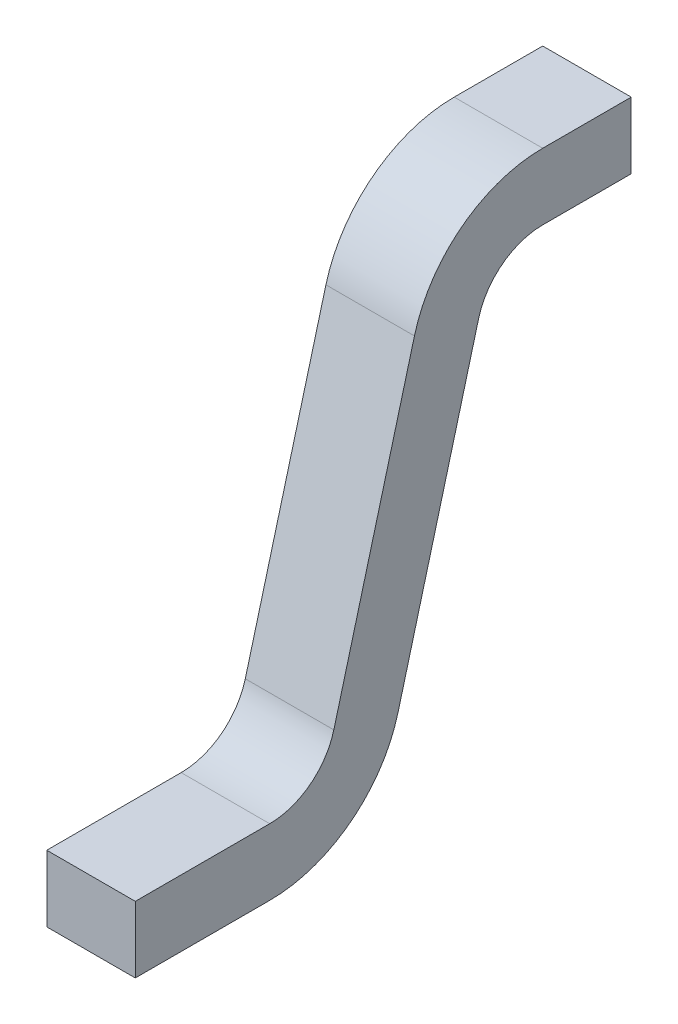
ISO-10303-21;
HEADER;
FILE_DESCRIPTION(('STEP AP214'),'2;1');
FILE_NAME('part.step','',(''),(''),'','','');
FILE_SCHEMA(('AUTOMOTIVE_DESIGN { 1 0 10303 214 1 1 1 1 }'));
ENDSEC;
DATA;
#1=APPLICATION_CONTEXT('core data for automotive mechanical design processes');
#2=APPLICATION_PROTOCOL_DEFINITION('international standard','automotive_design',2000,#1);
#3=PRODUCT_CONTEXT('',#1,'mechanical');
#4=PRODUCT('Part','Part','',(#3));
#5=PRODUCT_RELATED_PRODUCT_CATEGORY('part','',(#4));
#6=PRODUCT_DEFINITION_FORMATION('','',#4);
#7=PRODUCT_DEFINITION_CONTEXT('part definition',#1,'design');
#8=PRODUCT_DEFINITION('design','',#6,#7);
#9=PRODUCT_DEFINITION_SHAPE('','',#8);
#10=(LENGTH_UNIT() NAMED_UNIT(*) SI_UNIT(.MILLI.,.METRE.));
#11=(NAMED_UNIT(*) PLANE_ANGLE_UNIT() SI_UNIT($,.RADIAN.));
#12=(NAMED_UNIT(*) SI_UNIT($,.STERADIAN.) SOLID_ANGLE_UNIT());
#13=UNCERTAINTY_MEASURE_WITH_UNIT(LENGTH_MEASURE(1.E-05),#10,'distance_accuracy_value','');
#14=(GEOMETRIC_REPRESENTATION_CONTEXT(3) GLOBAL_UNCERTAINTY_ASSIGNED_CONTEXT((#13)) GLOBAL_UNIT_ASSIGNED_CONTEXT((#10,
#11,#12)) REPRESENTATION_CONTEXT('',''));
#15=CARTESIAN_POINT('',(0.,0.,0.));
#16=DIRECTION('',(0.,0.,1.));
#17=DIRECTION('',(1.,0.,0.));
#18=AXIS2_PLACEMENT_3D('',#15,#16,#17);
#19=CARTESIAN_POINT('',(-0.1,-1.01320558087763,-0.479564779095964));
#20=DIRECTION('',(-1.,0.,0.));
#21=DIRECTION('',(0.,1.,0.));
#22=AXIS2_PLACEMENT_3D('',#19,#20,#21);
#23=PLANE('',#22);
#24=DIRECTION('',(0.,0.,-1.));
#25=VECTOR('',#24,1.);
#26=CARTESIAN_POINT('',(-0.1,0.,0.8));
#27=LINE('',#26,#25);
#28=CARTESIAN_POINT('',(-0.1,0.,0.2));
#29=VERTEX_POINT('',#28);
#30=CARTESIAN_POINT('',(-0.1,0.,0.));
#31=VERTEX_POINT('',#30);
#32=EDGE_CURVE('E212',#29,#31,#27,.T.);
#33=ORIENTED_EDGE('',*,*,#32,.F.);
#34=CARTESIAN_POINT('',(-0.1,-0.15,0.2));
#35=DIRECTION('',(1.,0.,0.));
#36=DIRECTION('',(0.,0.,-1.));
#37=AXIS2_PLACEMENT_3D('',#34,#35,#36);
#38=CIRCLE('',#37,0.15);
#39=CARTESIAN_POINT('',(-0.1,-0.111177143234622,0.34488887394336));
#40=VERTEX_POINT('',#39);
#41=EDGE_CURVE('E150',#29,#40,#38,.T.);
#42=ORIENTED_EDGE('',*,*,#41,.T.);
#43=DIRECTION('',(0.,0.965925826289068,-0.258819045102521));
#44=VECTOR('',#43,1.);
#45=CARTESIAN_POINT('',(-0.1,-0.501073546521664,0.449361300335922));
#46=LINE('',#45,#44);
#47=CARTESIAN_POINT('',(-0.1,-0.790851294408385,0.527007013866678));
#48=VERTEX_POINT('',#47);
#49=EDGE_CURVE('E145',#48,#40,#46,.T.);
#50=ORIENTED_EDGE('',*,*,#49,.F.);
#51=CARTESIAN_POINT('',(-0.1,-0.713205580877628,0.816784761753399));
#52=DIRECTION('',(1.,0.,0.));
#53=DIRECTION('',(0.,-1.,0.));
#54=AXIS2_PLACEMENT_3D('',#51,#52,#53);
#55=CIRCLE('',#54,0.3);
#56=CARTESIAN_POINT('',(-0.1,-1.01320558087763,0.816784761753399));
#57=VERTEX_POINT('',#56);
#58=EDGE_CURVE('E225',#57,#48,#55,.T.);
#59=ORIENTED_EDGE('',*,*,#58,.F.);
#60=DIRECTION('',(0.,0.,-1.));
#61=VECTOR('',#60,1.);
#62=CARTESIAN_POINT('',(-0.1,-1.01320558087763,0.320435220904037));
#63=LINE('',#62,#61);
#64=CARTESIAN_POINT('',(-0.1,-1.01320558087763,1.12043522090404));
#65=VERTEX_POINT('',#64);
#66=EDGE_CURVE('E192',#65,#57,#63,.T.);
#67=ORIENTED_EDGE('',*,*,#66,.F.);
#68=DIRECTION('',(0.,-1.,0.));
#69=VECTOR('',#68,1.);
#70=CARTESIAN_POINT('',(-0.1,-1.01320558087763,1.12043522090404));
#71=LINE('',#70,#69);
#72=CARTESIAN_POINT('',(-0.1,-0.863205580877628,1.12043522090404));
#73=VERTEX_POINT('',#72);
#74=EDGE_CURVE('E185',#73,#65,#71,.T.);
#75=ORIENTED_EDGE('',*,*,#74,.F.);
#76=DIRECTION('',(0.,0.,1.));
#77=VECTOR('',#76,1.);
#78=CARTESIAN_POINT('',(-0.1,-0.863205580877628,0.320435220904037));
#79=LINE('',#78,#77);
#80=CARTESIAN_POINT('',(-0.1,-0.863205580877628,0.816784761753399));
#81=VERTEX_POINT('',#80);
#82=EDGE_CURVE('E237',#81,#73,#79,.T.);
#83=ORIENTED_EDGE('',*,*,#82,.F.);
#84=CARTESIAN_POINT('',(-0.1,-0.713205580877628,0.816784761753399));
#85=DIRECTION('',(1.,0.,0.));
#86=DIRECTION('',(0.,-1.,0.));
#87=AXIS2_PLACEMENT_3D('',#84,#85,#86);
#88=CIRCLE('',#87,0.15);
#89=CARTESIAN_POINT('',(-0.1,-0.752028437643006,0.671895887810039));
#90=VERTEX_POINT('',#89);
#91=EDGE_CURVE('E20',#81,#90,#88,.T.);
#92=ORIENTED_EDGE('',*,*,#91,.T.);
#93=DIRECTION('',(0.,-0.965925826289068,0.258819045102521));
#94=VECTOR('',#93,1.);
#95=CARTESIAN_POINT('',(-0.1,-0.462250689756285,0.594250174279283));
#96=LINE('',#95,#94);
#97=CARTESIAN_POINT('',(-0.1,-0.0723542864692436,0.489777747886721));
#98=VERTEX_POINT('',#97);
#99=EDGE_CURVE('E11',#98,#90,#96,.T.);
#100=ORIENTED_EDGE('',*,*,#99,.F.);
#101=CARTESIAN_POINT('',(-0.1,-0.15,0.2));
#102=DIRECTION('',(1.,0.,0.));
#103=DIRECTION('',(0.,0.,-1.));
#104=AXIS2_PLACEMENT_3D('',#101,#102,#103);
#105=CIRCLE('',#104,0.3);
#106=CARTESIAN_POINT('',(-0.1,0.15,0.2));
#107=VERTEX_POINT('',#106);
#108=EDGE_CURVE('E200',#107,#98,#105,.T.);
#109=ORIENTED_EDGE('',*,*,#108,.F.);
#110=DIRECTION('',(0.,0.,1.));
#111=VECTOR('',#110,1.);
#112=CARTESIAN_POINT('',(-0.1,0.15,0.8));
#113=LINE('',#112,#111);
#114=CARTESIAN_POINT('',(-0.1,0.15,0.));
#115=VERTEX_POINT('',#114);
#116=EDGE_CURVE('E183',#115,#107,#113,.T.);
#117=ORIENTED_EDGE('',*,*,#116,.F.);
#118=DIRECTION('',(0.,1.,0.));
#119=VECTOR('',#118,1.);
#120=CARTESIAN_POINT('',(-0.1,0.,0.));
#121=LINE('',#120,#119);
#122=EDGE_CURVE('E207',#31,#115,#121,.T.);
#123=ORIENTED_EDGE('',*,*,#122,.F.);
#124=EDGE_LOOP('',(#33,#42,#50,#59,#67,#75,#83,#92,#100,#109,#117,#123));
#125=FACE_BOUND('',#124,.T.);
#126=ADVANCED_FACE('F17',(#125),#23,.T.);
#127=CARTESIAN_POINT('',(0.,-0.462250689756285,0.594250174279283));
#128=DIRECTION('',(0.,0.258819045102521,0.965925826289068));
#129=DIRECTION('',(1.,0.,0.));
#130=AXIS2_PLACEMENT_3D('',#127,#128,#129);
#131=PLANE('',#130);
#132=DIRECTION('',(1.,0.,0.));
#133=VECTOR('',#132,1.);
#134=CARTESIAN_POINT('',(-0.297707469156736,-0.752028437643007,0.671895887810039));
#135=LINE('',#134,#133);
#136=CARTESIAN_POINT('',(0.1,-0.752028437643007,0.671895887810039));
#137=VERTEX_POINT('',#136);
#138=EDGE_CURVE('E239',#90,#137,#135,.T.);
#139=ORIENTED_EDGE('',*,*,#138,.T.);
#140=DIRECTION('',(0.,-0.965925826289068,0.258819045102521));
#141=VECTOR('',#140,1.);
#142=CARTESIAN_POINT('',(0.1,-0.0723542864692437,0.48977774788672));
#143=LINE('',#142,#141);
#144=CARTESIAN_POINT('',(0.1,-0.0723542864692436,0.48977774788672));
#145=VERTEX_POINT('',#144);
#146=EDGE_CURVE('E260',#145,#137,#143,.T.);
#147=ORIENTED_EDGE('',*,*,#146,.F.);
#148=DIRECTION('',(1.,0.,0.));
#149=VECTOR('',#148,1.);
#150=CARTESIAN_POINT('',(0.194661618624334,-0.0723542864692436,0.48977774788672));
#151=LINE('',#150,#149);
#152=EDGE_CURVE('E184',#98,#145,#151,.T.);
#153=ORIENTED_EDGE('',*,*,#152,.F.);
#154=ORIENTED_EDGE('',*,*,#99,.T.);
#155=EDGE_LOOP('',(#139,#147,#153,#154));
#156=FACE_BOUND('',#155,.T.);
#157=ADVANCED_FACE('F322',(#156),#131,.T.);
#158=CARTESIAN_POINT('',(-0.297707469156736,-0.713205580877628,0.816784761753399));
#159=DIRECTION('',(-1.,0.,0.));
#160=DIRECTION('',(0.,-1.,0.));
#161=AXIS2_PLACEMENT_3D('',#158,#159,#160);
#162=CYLINDRICAL_SURFACE('',#161,0.15);
#163=CARTESIAN_POINT('',(0.1,-0.713205580877628,0.816784761753399));
#164=DIRECTION('',(-1.,0.,0.));
#165=DIRECTION('',(0.,-1.,0.));
#166=AXIS2_PLACEMENT_3D('',#163,#164,#165);
#167=CIRCLE('',#166,0.15);
#168=CARTESIAN_POINT('',(0.1,-0.863205580877628,0.816784761753399));
#169=VERTEX_POINT('',#168);
#170=EDGE_CURVE('E254',#137,#169,#167,.T.);
#171=ORIENTED_EDGE('',*,*,#170,.F.);
#172=ORIENTED_EDGE('',*,*,#138,.F.);
#173=ORIENTED_EDGE('',*,*,#91,.F.);
#174=DIRECTION('',(-1.,0.,0.));
#175=VECTOR('',#174,1.);
#176=CARTESIAN_POINT('',(0.,-0.863205580877628,0.816784761753399));
#177=LINE('',#176,#175);
#178=EDGE_CURVE('E188',#169,#81,#177,.T.);
#179=ORIENTED_EDGE('',*,*,#178,.F.);
#180=EDGE_LOOP('',(#171,#172,#173,#179));
#181=FACE_BOUND('',#180,.T.);
#182=ADVANCED_FACE('F252',(#181),#162,.F.);
#183=CARTESIAN_POINT('',(0.,-0.863205580877628,0.320435220904037));
#184=DIRECTION('',(0.,1.,0.));
#185=DIRECTION('',(0.,0.,-1.));
#186=AXIS2_PLACEMENT_3D('',#183,#184,#185);
#187=PLANE('',#186);
#188=DIRECTION('',(-1.,0.,0.));
#189=VECTOR('',#188,1.);
#190=CARTESIAN_POINT('',(-0.1,-0.863205580877628,1.12043522090404));
#191=LINE('',#190,#189);
#192=CARTESIAN_POINT('',(0.1,-0.863205580877628,1.12043522090404));
#193=VERTEX_POINT('',#192);
#194=EDGE_CURVE('E189',#193,#73,#191,.T.);
#195=ORIENTED_EDGE('',*,*,#194,.F.);
#196=DIRECTION('',(0.,0.,1.));
#197=VECTOR('',#196,1.);
#198=CARTESIAN_POINT('',(0.1,-0.863205580877628,1.12043522090404));
#199=LINE('',#198,#197);
#200=EDGE_CURVE('E259',#169,#193,#199,.T.);
#201=ORIENTED_EDGE('',*,*,#200,.F.);
#202=ORIENTED_EDGE('',*,*,#178,.T.);
#203=ORIENTED_EDGE('',*,*,#82,.T.);
#204=EDGE_LOOP('',(#195,#201,#202,#203));
#205=FACE_BOUND('',#204,.T.);
#206=ADVANCED_FACE('F330',(#205),#187,.T.);
#207=CARTESIAN_POINT('',(-0.1,-1.01320558087763,1.12043522090404));
#208=DIRECTION('',(0.,0.,1.));
#209=DIRECTION('',(0.,-1.,0.));
#210=AXIS2_PLACEMENT_3D('',#207,#208,#209);
#211=PLANE('',#210);
#212=ORIENTED_EDGE('',*,*,#194,.T.);
#213=ORIENTED_EDGE('',*,*,#74,.T.);
#214=DIRECTION('',(-1.,0.,0.));
#215=VECTOR('',#214,1.);
#216=CARTESIAN_POINT('',(0.,-1.01320558087763,1.12043522090404));
#217=LINE('',#216,#215);
#218=CARTESIAN_POINT('',(0.1,-1.01320558087763,1.12043522090404));
#219=VERTEX_POINT('',#218);
#220=EDGE_CURVE('E228',#219,#65,#217,.T.);
#221=ORIENTED_EDGE('',*,*,#220,.F.);
#222=DIRECTION('',(0.,-1.,0.));
#223=VECTOR('',#222,1.);
#224=CARTESIAN_POINT('',(0.1,-1.01320558087763,1.12043522090404));
#225=LINE('',#224,#223);
#226=EDGE_CURVE('E276',#193,#219,#225,.T.);
#227=ORIENTED_EDGE('',*,*,#226,.F.);
#228=EDGE_LOOP('',(#212,#213,#221,#227));
#229=FACE_BOUND('',#228,.T.);
#230=ADVANCED_FACE('F338',(#229),#211,.T.);
#231=CARTESIAN_POINT('',(0.,-1.01320558087763,0.320435220904037));
#232=DIRECTION('',(0.,-1.,0.));
#233=DIRECTION('',(0.,0.,-1.));
#234=AXIS2_PLACEMENT_3D('',#231,#232,#233);
#235=PLANE('',#234);
#236=ORIENTED_EDGE('',*,*,#220,.T.);
#237=ORIENTED_EDGE('',*,*,#66,.T.);
#238=DIRECTION('',(-1.,0.,0.));
#239=VECTOR('',#238,1.);
#240=CARTESIAN_POINT('',(-0.297707469156736,-1.01320558087763,0.816784761753399));
#241=LINE('',#240,#239);
#242=CARTESIAN_POINT('',(0.1,-1.01320558087763,0.816784761753399));
#243=VERTEX_POINT('',#242);
#244=EDGE_CURVE('E221',#243,#57,#241,.T.);
#245=ORIENTED_EDGE('',*,*,#244,.F.);
#246=DIRECTION('',(0.,0.,-1.));
#247=VECTOR('',#246,1.);
#248=CARTESIAN_POINT('',(0.1,-1.01320558087763,1.12043522090404));
#249=LINE('',#248,#247);
#250=EDGE_CURVE('E174',#219,#243,#249,.T.);
#251=ORIENTED_EDGE('',*,*,#250,.F.);
#252=EDGE_LOOP('',(#236,#237,#245,#251));
#253=FACE_BOUND('',#252,.T.);
#254=ADVANCED_FACE('F334',(#253),#235,.T.);
#255=CARTESIAN_POINT('',(-0.297707469156736,-0.713205580877628,0.816784761753399));
#256=DIRECTION('',(-1.,0.,0.));
#257=DIRECTION('',(0.,-1.,0.));
#258=AXIS2_PLACEMENT_3D('',#255,#256,#257);
#259=CYLINDRICAL_SURFACE('',#258,0.3);
#260=DIRECTION('',(-1.,0.,0.));
#261=VECTOR('',#260,1.);
#262=CARTESIAN_POINT('',(0.,-0.790851294408385,0.527007013866679));
#263=LINE('',#262,#261);
#264=CARTESIAN_POINT('',(0.1,-0.790851294408385,0.527007013866679));
#265=VERTEX_POINT('',#264);
#266=EDGE_CURVE('E149',#265,#48,#263,.T.);
#267=ORIENTED_EDGE('',*,*,#266,.F.);
#268=CARTESIAN_POINT('',(0.1,-0.713205580877628,0.816784761753399));
#269=DIRECTION('',(1.,0.,0.));
#270=DIRECTION('',(0.,-1.,0.));
#271=AXIS2_PLACEMENT_3D('',#268,#269,#270);
#272=CIRCLE('',#271,0.3);
#273=EDGE_CURVE('E167',#243,#265,#272,.T.);
#274=ORIENTED_EDGE('',*,*,#273,.F.);
#275=ORIENTED_EDGE('',*,*,#244,.T.);
#276=ORIENTED_EDGE('',*,*,#58,.T.);
#277=EDGE_LOOP('',(#267,#274,#275,#276));
#278=FACE_BOUND('',#277,.T.);
#279=ADVANCED_FACE('F337',(#278),#259,.T.);
#280=CARTESIAN_POINT('',(0.,-0.501073546521664,0.449361300335922));
#281=DIRECTION('',(0.,-0.258819045102521,-0.965925826289068));
#282=DIRECTION('',(0.,-0.965925826289068,0.258819045102521));
#283=AXIS2_PLACEMENT_3D('',#280,#281,#282);
#284=PLANE('',#283);
#285=ORIENTED_EDGE('',*,*,#266,.T.);
#286=ORIENTED_EDGE('',*,*,#49,.T.);
#287=DIRECTION('',(1.,0.,0.));
#288=VECTOR('',#287,1.);
#289=CARTESIAN_POINT('',(0.194661618624334,-0.111177143234622,0.34488887394336));
#290=LINE('',#289,#288);
#291=CARTESIAN_POINT('',(0.1,-0.111177143234622,0.34488887394336));
#292=VERTEX_POINT('',#291);
#293=EDGE_CURVE('E137',#40,#292,#290,.T.);
#294=ORIENTED_EDGE('',*,*,#293,.T.);
#295=DIRECTION('',(0.,0.965925826289068,-0.258819045102521));
#296=VECTOR('',#295,1.);
#297=CARTESIAN_POINT('',(0.1,-0.790851294408385,0.527007013866679));
#298=LINE('',#297,#296);
#299=EDGE_CURVE('E142',#265,#292,#298,.T.);
#300=ORIENTED_EDGE('',*,*,#299,.F.);
#301=EDGE_LOOP('',(#285,#286,#294,#300));
#302=FACE_BOUND('',#301,.T.);
#303=ADVANCED_FACE('F140',(#302),#284,.T.);
#304=CARTESIAN_POINT('',(0.194661618624334,-0.15,0.2));
#305=DIRECTION('',(1.,0.,0.));
#306=DIRECTION('',(0.,0.,-1.));
#307=AXIS2_PLACEMENT_3D('',#304,#305,#306);
#308=CYLINDRICAL_SURFACE('',#307,0.15);
#309=ORIENTED_EDGE('',*,*,#41,.F.);
#310=DIRECTION('',(-1.,0.,0.));
#311=VECTOR('',#310,1.);
#312=CARTESIAN_POINT('',(0.,0.,0.2));
#313=LINE('',#312,#311);
#314=CARTESIAN_POINT('',(0.1,0.,0.2));
#315=VERTEX_POINT('',#314);
#316=EDGE_CURVE('E156',#315,#29,#313,.T.);
#317=ORIENTED_EDGE('',*,*,#316,.F.);
#318=CARTESIAN_POINT('',(0.1,-0.15,0.2));
#319=DIRECTION('',(-1.,0.,0.));
#320=DIRECTION('',(0.,0.,-1.));
#321=AXIS2_PLACEMENT_3D('',#318,#319,#320);
#322=CIRCLE('',#321,0.15);
#323=EDGE_CURVE('E153',#292,#315,#322,.T.);
#324=ORIENTED_EDGE('',*,*,#323,.F.);
#325=ORIENTED_EDGE('',*,*,#293,.F.);
#326=EDGE_LOOP('',(#309,#317,#324,#325));
#327=FACE_BOUND('',#326,.T.);
#328=ADVANCED_FACE('F154',(#327),#308,.F.);
#329=CARTESIAN_POINT('',(0.,0.,0.8));
#330=DIRECTION('',(0.,-1.,0.));
#331=DIRECTION('',(0.,0.,-1.));
#332=AXIS2_PLACEMENT_3D('',#329,#330,#331);
#333=PLANE('',#332);
#334=DIRECTION('',(-1.,0.,0.));
#335=VECTOR('',#334,1.);
#336=CARTESIAN_POINT('',(0.1,0.,0.));
#337=LINE('',#336,#335);
#338=CARTESIAN_POINT('',(0.1,0.,0.));
#339=VERTEX_POINT('',#338);
#340=EDGE_CURVE('E203',#339,#31,#337,.T.);
#341=ORIENTED_EDGE('',*,*,#340,.F.);
#342=DIRECTION('',(0.,0.,-1.));
#343=VECTOR('',#342,1.);
#344=CARTESIAN_POINT('',(0.1,0.,1.12043522090404));
#345=LINE('',#344,#343);
#346=EDGE_CURVE('E161',#315,#339,#345,.T.);
#347=ORIENTED_EDGE('',*,*,#346,.F.);
#348=ORIENTED_EDGE('',*,*,#316,.T.);
#349=ORIENTED_EDGE('',*,*,#32,.T.);
#350=EDGE_LOOP('',(#341,#347,#348,#349));
#351=FACE_BOUND('',#350,.T.);
#352=ADVANCED_FACE('F310',(#351),#333,.T.);
#353=CARTESIAN_POINT('',(0.1,0.,0.));
#354=DIRECTION('',(0.,0.,-1.));
#355=DIRECTION('',(-1.,0.,0.));
#356=AXIS2_PLACEMENT_3D('',#353,#354,#355);
#357=PLANE('',#356);
#358=DIRECTION('',(-1.,0.,0.));
#359=VECTOR('',#358,1.);
#360=CARTESIAN_POINT('',(0.,0.15,0.));
#361=LINE('',#360,#359);
#362=CARTESIAN_POINT('',(0.1,0.15,0.));
#363=VERTEX_POINT('',#362);
#364=EDGE_CURVE('E179',#363,#115,#361,.T.);
#365=ORIENTED_EDGE('',*,*,#364,.F.);
#366=DIRECTION('',(0.,1.,0.));
#367=VECTOR('',#366,1.);
#368=CARTESIAN_POINT('',(0.1,-1.01320558087763,0.));
#369=LINE('',#368,#367);
#370=EDGE_CURVE('E194',#339,#363,#369,.T.);
#371=ORIENTED_EDGE('',*,*,#370,.F.);
#372=ORIENTED_EDGE('',*,*,#340,.T.);
#373=ORIENTED_EDGE('',*,*,#122,.T.);
#374=EDGE_LOOP('',(#365,#371,#372,#373));
#375=FACE_BOUND('',#374,.T.);
#376=ADVANCED_FACE('F308',(#375),#357,.T.);
#377=CARTESIAN_POINT('',(0.,0.15,0.8));
#378=DIRECTION('',(0.,1.,0.));
#379=DIRECTION('',(1.,0.,0.));
#380=AXIS2_PLACEMENT_3D('',#377,#378,#379);
#381=PLANE('',#380);
#382=ORIENTED_EDGE('',*,*,#364,.T.);
#383=ORIENTED_EDGE('',*,*,#116,.T.);
#384=DIRECTION('',(-1.,0.,0.));
#385=VECTOR('',#384,1.);
#386=CARTESIAN_POINT('',(0.194661618624334,0.15,0.2));
#387=LINE('',#386,#385);
#388=CARTESIAN_POINT('',(0.1,0.15,0.2));
#389=VERTEX_POINT('',#388);
#390=EDGE_CURVE('E178',#389,#107,#387,.T.);
#391=ORIENTED_EDGE('',*,*,#390,.F.);
#392=DIRECTION('',(0.,0.,1.));
#393=VECTOR('',#392,1.);
#394=CARTESIAN_POINT('',(0.1,0.15,1.12043522090404));
#395=LINE('',#394,#393);
#396=EDGE_CURVE('E270',#363,#389,#395,.T.);
#397=ORIENTED_EDGE('',*,*,#396,.F.);
#398=EDGE_LOOP('',(#382,#383,#391,#397));
#399=FACE_BOUND('',#398,.T.);
#400=ADVANCED_FACE('F303',(#399),#381,.T.);
#401=CARTESIAN_POINT('',(0.194661618624334,-0.15,0.2));
#402=DIRECTION('',(1.,0.,0.));
#403=DIRECTION('',(0.,0.,-1.));
#404=AXIS2_PLACEMENT_3D('',#401,#402,#403);
#405=CYLINDRICAL_SURFACE('',#404,0.3);
#406=ORIENTED_EDGE('',*,*,#390,.T.);
#407=ORIENTED_EDGE('',*,*,#108,.T.);
#408=ORIENTED_EDGE('',*,*,#152,.T.);
#409=CARTESIAN_POINT('',(0.1,-0.15,0.2));
#410=DIRECTION('',(1.,0.,0.));
#411=DIRECTION('',(0.,0.,-1.));
#412=AXIS2_PLACEMENT_3D('',#409,#410,#411);
#413=CIRCLE('',#412,0.3);
#414=EDGE_CURVE('E264',#389,#145,#413,.T.);
#415=ORIENTED_EDGE('',*,*,#414,.F.);
#416=EDGE_LOOP('',(#406,#407,#408,#415));
#417=FACE_BOUND('',#416,.T.);
#418=ADVANCED_FACE('F300',(#417),#405,.T.);
#419=CARTESIAN_POINT('',(0.1,-1.01320558087763,1.12043522090404));
#420=DIRECTION('',(1.,0.,0.));
#421=DIRECTION('',(0.,0.,-1.));
#422=AXIS2_PLACEMENT_3D('',#419,#420,#421);
#423=PLANE('',#422);
#424=ORIENTED_EDGE('',*,*,#396,.T.);
#425=ORIENTED_EDGE('',*,*,#414,.T.);
#426=ORIENTED_EDGE('',*,*,#146,.T.);
#427=ORIENTED_EDGE('',*,*,#170,.T.);
#428=ORIENTED_EDGE('',*,*,#200,.T.);
#429=ORIENTED_EDGE('',*,*,#226,.T.);
#430=ORIENTED_EDGE('',*,*,#250,.T.);
#431=ORIENTED_EDGE('',*,*,#273,.T.);
#432=ORIENTED_EDGE('',*,*,#299,.T.);
#433=ORIENTED_EDGE('',*,*,#323,.T.);
#434=ORIENTED_EDGE('',*,*,#346,.T.);
#435=ORIENTED_EDGE('',*,*,#370,.T.);
#436=EDGE_LOOP('',(#424,#425,#426,#427,#428,#429,#430,#431,#432,#433,#434,#435));
#437=FACE_BOUND('',#436,.T.);
#438=ADVANCED_FACE('F164',(#437),#423,.T.);
#439=CLOSED_SHELL('',(#126,#157,#182,#206,#230,#254,#279,#303,#328,#352,#376,#400,#418,#438));
#440=MANIFOLD_SOLID_BREP('B1',#439);
#441=ADVANCED_BREP_SHAPE_REPRESENTATION('',(#18,#440),#14);
#442=SHAPE_DEFINITION_REPRESENTATION(#9,#441);
ENDSEC;
END-ISO-10303-21;
